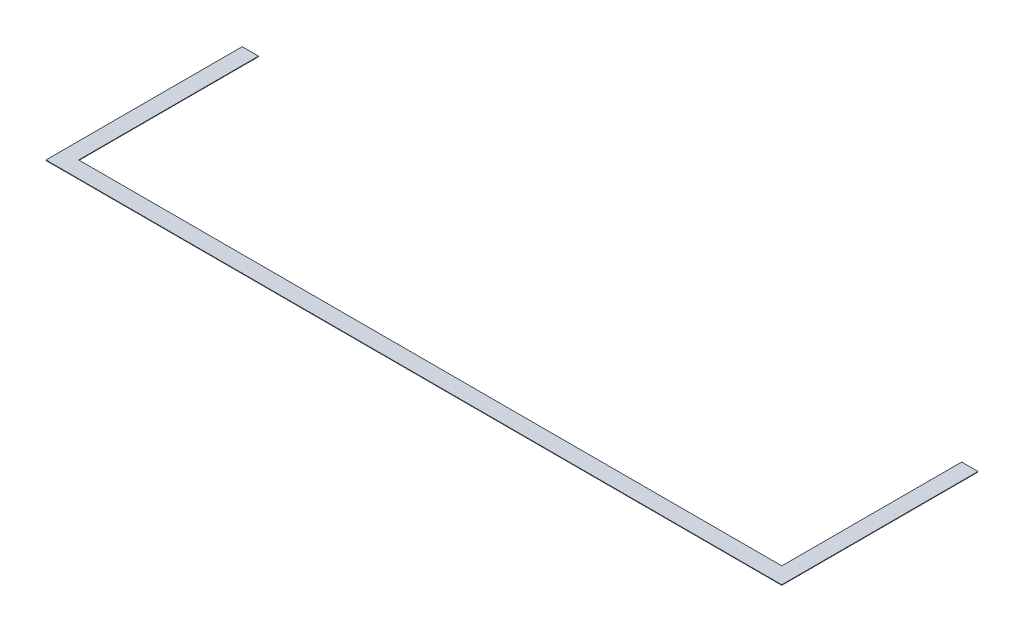
ISO-10303-21;
HEADER;
FILE_DESCRIPTION(('STEP AP214'),'2;1');
FILE_NAME('part.step','',(''),(''),'','','');
FILE_SCHEMA(('AUTOMOTIVE_DESIGN { 1 0 10303 214 1 1 1 1 }'));
ENDSEC;
DATA;
#1=APPLICATION_CONTEXT('core data for automotive mechanical design processes');
#2=APPLICATION_PROTOCOL_DEFINITION('international standard','automotive_design',2000,#1);
#3=PRODUCT_CONTEXT('',#1,'mechanical');
#4=PRODUCT('Part','Part','',(#3));
#5=PRODUCT_RELATED_PRODUCT_CATEGORY('part','',(#4));
#6=PRODUCT_DEFINITION_FORMATION('','',#4);
#7=PRODUCT_DEFINITION_CONTEXT('part definition',#1,'design');
#8=PRODUCT_DEFINITION('design','',#6,#7);
#9=PRODUCT_DEFINITION_SHAPE('','',#8);
#10=(LENGTH_UNIT() NAMED_UNIT(*) SI_UNIT(.MILLI.,.METRE.));
#11=(NAMED_UNIT(*) PLANE_ANGLE_UNIT() SI_UNIT($,.RADIAN.));
#12=(NAMED_UNIT(*) SI_UNIT($,.STERADIAN.) SOLID_ANGLE_UNIT());
#13=UNCERTAINTY_MEASURE_WITH_UNIT(LENGTH_MEASURE(1.E-05),#10,'distance_accuracy_value','');
#14=(GEOMETRIC_REPRESENTATION_CONTEXT(3) GLOBAL_UNCERTAINTY_ASSIGNED_CONTEXT((#13)) GLOBAL_UNIT_ASSIGNED_CONTEXT((#10,
#11,#12)) REPRESENTATION_CONTEXT('',''));
#15=CARTESIAN_POINT('',(0.,0.,0.));
#16=DIRECTION('',(0.,0.,1.));
#17=DIRECTION('',(1.,0.,0.));
#18=AXIS2_PLACEMENT_3D('',#15,#16,#17);
#19=CARTESIAN_POINT('',(0.,0.,0.));
#20=DIRECTION('',(0.,1.,0.));
#21=DIRECTION('',(0.,0.,1.));
#22=AXIS2_PLACEMENT_3D('',#19,#20,#21);
#23=PLANE('',#22);
#24=DIRECTION('',(0.,0.,1.));
#25=VECTOR('',#24,1.);
#26=CARTESIAN_POINT('',(50.8000000000002,0.,0.));
#27=LINE('',#26,#25);
#28=CARTESIAN_POINT('',(50.8,0.,0.));
#29=VERTEX_POINT('',#28);
#30=CARTESIAN_POINT('',(50.8000000000002,0.,558.8));
#31=VERTEX_POINT('',#30);
#32=EDGE_CURVE('E178',#29,#31,#27,.T.);
#33=ORIENTED_EDGE('',*,*,#32,.T.);
#34=DIRECTION('',(-1.,0.,0.));
#35=VECTOR('',#34,1.);
#36=CARTESIAN_POINT('',(0.,0.,558.8));
#37=LINE('',#36,#35);
#38=CARTESIAN_POINT('',(2235.2,0.,558.799999999999));
#39=VERTEX_POINT('',#38);
#40=EDGE_CURVE('E191',#39,#31,#37,.T.);
#41=ORIENTED_EDGE('',*,*,#40,.F.);
#42=DIRECTION('',(0.,0.,1.));
#43=VECTOR('',#42,1.);
#44=CARTESIAN_POINT('',(2235.2,0.,0.));
#45=LINE('',#44,#43);
#46=CARTESIAN_POINT('',(2235.2,0.,-1.84651795170424E-13));
#47=VERTEX_POINT('',#46);
#48=EDGE_CURVE('E129',#47,#39,#45,.T.);
#49=ORIENTED_EDGE('',*,*,#48,.F.);
#50=DIRECTION('',(-1.,0.,0.));
#51=VECTOR('',#50,1.);
#52=CARTESIAN_POINT('',(0.,0.,0.));
#53=LINE('',#52,#51);
#54=CARTESIAN_POINT('',(2286.,0.,-1.94289029309402E-13));
#55=VERTEX_POINT('',#54);
#56=EDGE_CURVE('E169',#55,#47,#53,.T.);
#57=ORIENTED_EDGE('',*,*,#56,.F.);
#58=DIRECTION('',(0.,0.,-1.));
#59=VECTOR('',#58,1.);
#60=CARTESIAN_POINT('',(2286.,0.,0.));
#61=LINE('',#60,#59);
#62=CARTESIAN_POINT('',(2286.,0.,609.6));
#63=VERTEX_POINT('',#62);
#64=EDGE_CURVE('E187',#63,#55,#61,.T.);
#65=ORIENTED_EDGE('',*,*,#64,.F.);
#66=DIRECTION('',(1.,0.,0.));
#67=VECTOR('',#66,1.);
#68=CARTESIAN_POINT('',(0.,0.,609.6));
#69=LINE('',#68,#67);
#70=CARTESIAN_POINT('',(0.,0.,609.6));
#71=VERTEX_POINT('',#70);
#72=EDGE_CURVE('E185',#71,#63,#69,.T.);
#73=ORIENTED_EDGE('',*,*,#72,.F.);
#74=DIRECTION('',(0.,0.,1.));
#75=VECTOR('',#74,1.);
#76=CARTESIAN_POINT('',(0.,0.,0.));
#77=LINE('',#76,#75);
#78=CARTESIAN_POINT('',(0.,0.,0.));
#79=VERTEX_POINT('',#78);
#80=EDGE_CURVE('E183',#79,#71,#77,.T.);
#81=ORIENTED_EDGE('',*,*,#80,.F.);
#82=DIRECTION('',(-1.,0.,0.));
#83=VECTOR('',#82,1.);
#84=CARTESIAN_POINT('',(0.,0.,0.));
#85=LINE('',#84,#83);
#86=EDGE_CURVE('E181',#29,#79,#85,.T.);
#87=ORIENTED_EDGE('',*,*,#86,.F.);
#88=EDGE_LOOP('',(#33,#41,#49,#57,#65,#73,#81,#87));
#89=FACE_BOUND('',#88,.T.);
#90=ADVANCED_FACE('F84',(#89),#23,.F.);
#91=CARTESIAN_POINT('',(0.,1.5875,558.8));
#92=DIRECTION('',(0.,0.,1.));
#93=DIRECTION('',(1.,0.,0.));
#94=AXIS2_PLACEMENT_3D('',#91,#92,#93);
#95=PLANE('',#94);
#96=ORIENTED_EDGE('',*,*,#40,.T.);
#97=DIRECTION('',(0.,-1.,0.));
#98=VECTOR('',#97,1.);
#99=CARTESIAN_POINT('',(50.8000000000002,1.5875,558.8));
#100=LINE('',#99,#98);
#101=CARTESIAN_POINT('',(50.8000000000002,1.5875,558.8));
#102=VERTEX_POINT('',#101);
#103=EDGE_CURVE('E136',#102,#31,#100,.T.);
#104=ORIENTED_EDGE('',*,*,#103,.F.);
#105=DIRECTION('',(-1.,0.,0.));
#106=VECTOR('',#105,1.);
#107=CARTESIAN_POINT('',(0.,1.5875,558.8));
#108=LINE('',#107,#106);
#109=CARTESIAN_POINT('',(2235.2,1.5875,558.799999999999));
#110=VERTEX_POINT('',#109);
#111=EDGE_CURVE('E101',#110,#102,#108,.T.);
#112=ORIENTED_EDGE('',*,*,#111,.F.);
#113=DIRECTION('',(0.,-1.,0.));
#114=VECTOR('',#113,1.);
#115=CARTESIAN_POINT('',(2235.2,1.5875,558.799999999999));
#116=LINE('',#115,#114);
#117=EDGE_CURVE('E171',#110,#39,#116,.T.);
#118=ORIENTED_EDGE('',*,*,#117,.T.);
#119=EDGE_LOOP('',(#96,#104,#112,#118));
#120=FACE_BOUND('',#119,.T.);
#121=ADVANCED_FACE('F234',(#120),#95,.F.);
#122=CARTESIAN_POINT('',(2235.2,1.5875,0.));
#123=DIRECTION('',(1.,0.,0.));
#124=DIRECTION('',(0.,0.,-1.));
#125=AXIS2_PLACEMENT_3D('',#122,#123,#124);
#126=PLANE('',#125);
#127=ORIENTED_EDGE('',*,*,#48,.T.);
#128=ORIENTED_EDGE('',*,*,#117,.F.);
#129=DIRECTION('',(0.,0.,1.));
#130=VECTOR('',#129,1.);
#131=CARTESIAN_POINT('',(2235.2,1.5875,0.));
#132=LINE('',#131,#130);
#133=CARTESIAN_POINT('',(2235.2,1.5875,-1.84651795170424E-13));
#134=VERTEX_POINT('',#133);
#135=EDGE_CURVE('E159',#134,#110,#132,.T.);
#136=ORIENTED_EDGE('',*,*,#135,.F.);
#137=DIRECTION('',(0.,-1.,0.));
#138=VECTOR('',#137,1.);
#139=CARTESIAN_POINT('',(2235.2,1.5875,-1.84651795170424E-13));
#140=LINE('',#139,#138);
#141=EDGE_CURVE('E166',#134,#47,#140,.T.);
#142=ORIENTED_EDGE('',*,*,#141,.T.);
#143=EDGE_LOOP('',(#127,#128,#136,#142));
#144=FACE_BOUND('',#143,.T.);
#145=ADVANCED_FACE('F173',(#144),#126,.F.);
#146=CARTESIAN_POINT('',(0.,1.5875,0.));
#147=DIRECTION('',(0.,0.,1.));
#148=DIRECTION('',(1.,0.,0.));
#149=AXIS2_PLACEMENT_3D('',#146,#147,#148);
#150=PLANE('',#149);
#151=ORIENTED_EDGE('',*,*,#56,.T.);
#152=ORIENTED_EDGE('',*,*,#141,.F.);
#153=DIRECTION('',(-1.,0.,0.));
#154=VECTOR('',#153,1.);
#155=CARTESIAN_POINT('',(0.,1.5875,0.));
#156=LINE('',#155,#154);
#157=CARTESIAN_POINT('',(2286.,1.5875,-1.94289029309402E-13));
#158=VERTEX_POINT('',#157);
#159=EDGE_CURVE('E155',#158,#134,#156,.T.);
#160=ORIENTED_EDGE('',*,*,#159,.F.);
#161=DIRECTION('',(0.,-1.,0.));
#162=VECTOR('',#161,1.);
#163=CARTESIAN_POINT('',(2286.,1.5875,-1.94289029309402E-13));
#164=LINE('',#163,#162);
#165=EDGE_CURVE('E170',#158,#55,#164,.T.);
#166=ORIENTED_EDGE('',*,*,#165,.T.);
#167=EDGE_LOOP('',(#151,#152,#160,#166));
#168=FACE_BOUND('',#167,.T.);
#169=ADVANCED_FACE('F167',(#168),#150,.F.);
#170=CARTESIAN_POINT('',(2286.,1.5875,0.));
#171=DIRECTION('',(-1.,0.,0.));
#172=DIRECTION('',(0.,0.,1.));
#173=AXIS2_PLACEMENT_3D('',#170,#171,#172);
#174=PLANE('',#173);
#175=ORIENTED_EDGE('',*,*,#64,.T.);
#176=ORIENTED_EDGE('',*,*,#165,.F.);
#177=DIRECTION('',(0.,0.,-1.));
#178=VECTOR('',#177,1.);
#179=CARTESIAN_POINT('',(2286.,1.5875,0.));
#180=LINE('',#179,#178);
#181=CARTESIAN_POINT('',(2286.,1.5875,609.6));
#182=VERTEX_POINT('',#181);
#183=EDGE_CURVE('E161',#182,#158,#180,.T.);
#184=ORIENTED_EDGE('',*,*,#183,.F.);
#185=DIRECTION('',(0.,-1.,0.));
#186=VECTOR('',#185,1.);
#187=CARTESIAN_POINT('',(2286.,1.5875,609.6));
#188=LINE('',#187,#186);
#189=EDGE_CURVE('E197',#182,#63,#188,.T.);
#190=ORIENTED_EDGE('',*,*,#189,.T.);
#191=EDGE_LOOP('',(#175,#176,#184,#190));
#192=FACE_BOUND('',#191,.T.);
#193=ADVANCED_FACE('F220',(#192),#174,.F.);
#194=CARTESIAN_POINT('',(0.,1.5875,609.6));
#195=DIRECTION('',(0.,0.,-1.));
#196=DIRECTION('',(-1.,0.,0.));
#197=AXIS2_PLACEMENT_3D('',#194,#195,#196);
#198=PLANE('',#197);
#199=ORIENTED_EDGE('',*,*,#72,.T.);
#200=ORIENTED_EDGE('',*,*,#189,.F.);
#201=DIRECTION('',(1.,0.,0.));
#202=VECTOR('',#201,1.);
#203=CARTESIAN_POINT('',(0.,1.5875,609.6));
#204=LINE('',#203,#202);
#205=CARTESIAN_POINT('',(0.,1.5875,609.6));
#206=VERTEX_POINT('',#205);
#207=EDGE_CURVE('E221',#206,#182,#204,.T.);
#208=ORIENTED_EDGE('',*,*,#207,.F.);
#209=DIRECTION('',(0.,-1.,0.));
#210=VECTOR('',#209,1.);
#211=CARTESIAN_POINT('',(0.,1.5875,609.6));
#212=LINE('',#211,#210);
#213=EDGE_CURVE('E200',#206,#71,#212,.T.);
#214=ORIENTED_EDGE('',*,*,#213,.T.);
#215=EDGE_LOOP('',(#199,#200,#208,#214));
#216=FACE_BOUND('',#215,.T.);
#217=ADVANCED_FACE('F217',(#216),#198,.F.);
#218=CARTESIAN_POINT('',(0.,1.5875,0.));
#219=DIRECTION('',(1.,0.,0.));
#220=DIRECTION('',(0.,0.,-1.));
#221=AXIS2_PLACEMENT_3D('',#218,#219,#220);
#222=PLANE('',#221);
#223=ORIENTED_EDGE('',*,*,#80,.T.);
#224=ORIENTED_EDGE('',*,*,#213,.F.);
#225=DIRECTION('',(0.,0.,1.));
#226=VECTOR('',#225,1.);
#227=CARTESIAN_POINT('',(0.,1.5875,0.));
#228=LINE('',#227,#226);
#229=CARTESIAN_POINT('',(0.,1.5875,0.));
#230=VERTEX_POINT('',#229);
#231=EDGE_CURVE('E209',#230,#206,#228,.T.);
#232=ORIENTED_EDGE('',*,*,#231,.F.);
#233=DIRECTION('',(0.,-1.,0.));
#234=VECTOR('',#233,1.);
#235=CARTESIAN_POINT('',(0.,1.5875,0.));
#236=LINE('',#235,#234);
#237=EDGE_CURVE('E93',#230,#79,#236,.T.);
#238=ORIENTED_EDGE('',*,*,#237,.T.);
#239=EDGE_LOOP('',(#223,#224,#232,#238));
#240=FACE_BOUND('',#239,.T.);
#241=ADVANCED_FACE('F207',(#240),#222,.F.);
#242=CARTESIAN_POINT('',(0.,1.5875,0.));
#243=DIRECTION('',(0.,0.,1.));
#244=DIRECTION('',(1.,0.,0.));
#245=AXIS2_PLACEMENT_3D('',#242,#243,#244);
#246=PLANE('',#245);
#247=ORIENTED_EDGE('',*,*,#86,.T.);
#248=ORIENTED_EDGE('',*,*,#237,.F.);
#249=DIRECTION('',(-1.,0.,0.));
#250=VECTOR('',#249,1.);
#251=CARTESIAN_POINT('',(0.,1.5875,0.));
#252=LINE('',#251,#250);
#253=CARTESIAN_POINT('',(50.8,1.5875,0.));
#254=VERTEX_POINT('',#253);
#255=EDGE_CURVE('E225',#254,#230,#252,.T.);
#256=ORIENTED_EDGE('',*,*,#255,.F.);
#257=DIRECTION('',(0.,-1.,0.));
#258=VECTOR('',#257,1.);
#259=CARTESIAN_POINT('',(50.8,1.5875,0.));
#260=LINE('',#259,#258);
#261=EDGE_CURVE('E12',#254,#29,#260,.T.);
#262=ORIENTED_EDGE('',*,*,#261,.T.);
#263=EDGE_LOOP('',(#247,#248,#256,#262));
#264=FACE_BOUND('',#263,.T.);
#265=ADVANCED_FACE('F227',(#264),#246,.F.);
#266=CARTESIAN_POINT('',(50.8000000000002,1.5875,0.));
#267=DIRECTION('',(1.,0.,0.));
#268=DIRECTION('',(0.,0.,-1.));
#269=AXIS2_PLACEMENT_3D('',#266,#267,#268);
#270=PLANE('',#269);
#271=ORIENTED_EDGE('',*,*,#32,.F.);
#272=ORIENTED_EDGE('',*,*,#261,.F.);
#273=DIRECTION('',(0.,0.,1.));
#274=VECTOR('',#273,1.);
#275=CARTESIAN_POINT('',(50.8000000000002,1.5875,0.));
#276=LINE('',#275,#274);
#277=EDGE_CURVE('E193',#254,#102,#276,.T.);
#278=ORIENTED_EDGE('',*,*,#277,.T.);
#279=ORIENTED_EDGE('',*,*,#103,.T.);
#280=EDGE_LOOP('',(#271,#272,#278,#279));
#281=FACE_BOUND('',#280,.T.);
#282=ADVANCED_FACE('F86',(#281),#270,.T.);
#283=CARTESIAN_POINT('',(0.,1.5875,0.));
#284=DIRECTION('',(0.,1.,0.));
#285=DIRECTION('',(0.,0.,1.));
#286=AXIS2_PLACEMENT_3D('',#283,#284,#285);
#287=PLANE('',#286);
#288=ORIENTED_EDGE('',*,*,#277,.F.);
#289=ORIENTED_EDGE('',*,*,#255,.T.);
#290=ORIENTED_EDGE('',*,*,#231,.T.);
#291=ORIENTED_EDGE('',*,*,#207,.T.);
#292=ORIENTED_EDGE('',*,*,#183,.T.);
#293=ORIENTED_EDGE('',*,*,#159,.T.);
#294=ORIENTED_EDGE('',*,*,#135,.T.);
#295=ORIENTED_EDGE('',*,*,#111,.T.);
#296=EDGE_LOOP('',(#288,#289,#290,#291,#292,#293,#294,#295));
#297=FACE_BOUND('',#296,.T.);
#298=ADVANCED_FACE('F157',(#297),#287,.T.);
#299=CLOSED_SHELL('',(#90,#121,#145,#169,#193,#217,#241,#265,#282,#298));
#300=MANIFOLD_SOLID_BREP('B2',#299);
#301=ADVANCED_BREP_SHAPE_REPRESENTATION('',(#18,#300),#14);
#302=SHAPE_DEFINITION_REPRESENTATION(#9,#301);
ENDSEC;
END-ISO-10303-21;
